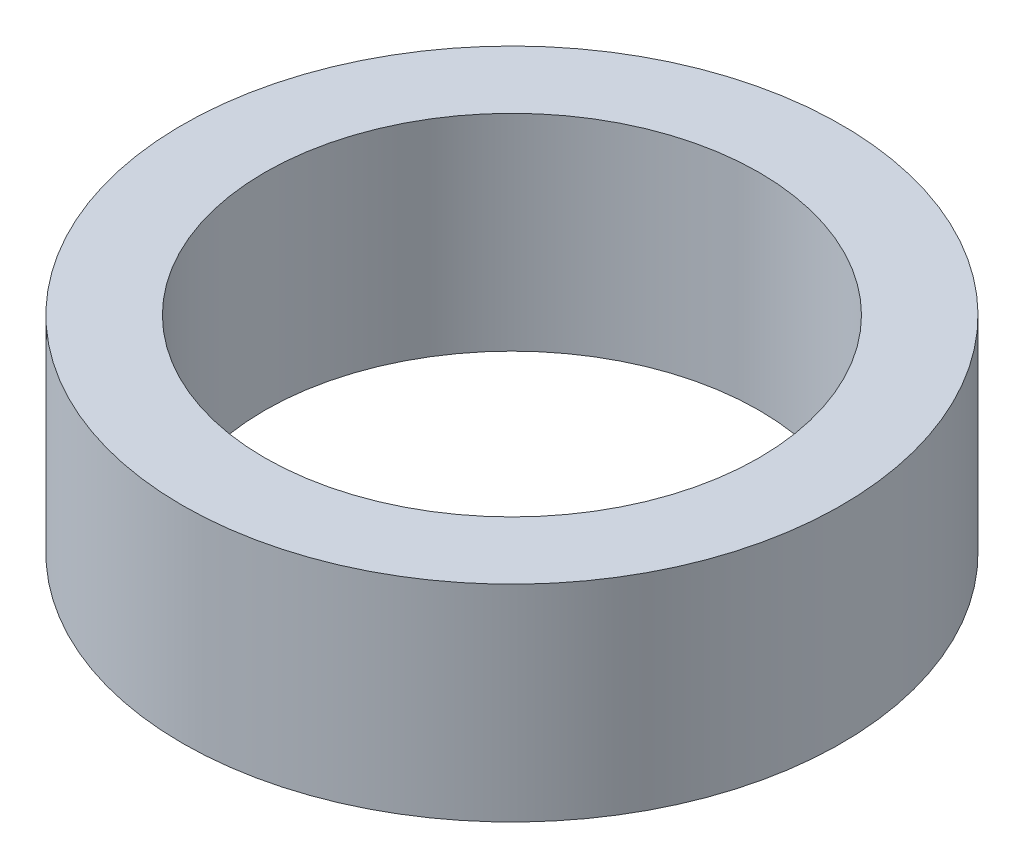
ISO-10303-21;
HEADER;
FILE_DESCRIPTION(('STEP AP214'),'2;1');
FILE_NAME('part.step','',(''),(''),'','','');
FILE_SCHEMA(('AUTOMOTIVE_DESIGN { 1 0 10303 214 1 1 1 1 }'));
ENDSEC;
DATA;
#1=APPLICATION_CONTEXT('core data for automotive mechanical design processes');
#2=APPLICATION_PROTOCOL_DEFINITION('international standard','automotive_design',2000,#1);
#3=PRODUCT_CONTEXT('',#1,'mechanical');
#4=PRODUCT('Part','Part','',(#3));
#5=PRODUCT_RELATED_PRODUCT_CATEGORY('part','',(#4));
#6=PRODUCT_DEFINITION_FORMATION('','',#4);
#7=PRODUCT_DEFINITION_CONTEXT('part definition',#1,'design');
#8=PRODUCT_DEFINITION('design','',#6,#7);
#9=PRODUCT_DEFINITION_SHAPE('','',#8);
#10=(LENGTH_UNIT() NAMED_UNIT(*) SI_UNIT(.MILLI.,.METRE.));
#11=(NAMED_UNIT(*) PLANE_ANGLE_UNIT() SI_UNIT($,.RADIAN.));
#12=(NAMED_UNIT(*) SI_UNIT($,.STERADIAN.) SOLID_ANGLE_UNIT());
#13=UNCERTAINTY_MEASURE_WITH_UNIT(LENGTH_MEASURE(1.E-05),#10,'distance_accuracy_value','');
#14=(GEOMETRIC_REPRESENTATION_CONTEXT(3) GLOBAL_UNCERTAINTY_ASSIGNED_CONTEXT((#13)) GLOBAL_UNIT_ASSIGNED_CONTEXT((#10,
#11,#12)) REPRESENTATION_CONTEXT('',''));
#15=CARTESIAN_POINT('',(0.,0.,0.));
#16=DIRECTION('',(0.,0.,1.));
#17=DIRECTION('',(1.,0.,0.));
#18=AXIS2_PLACEMENT_3D('',#15,#16,#17);
#19=CARTESIAN_POINT('',(0.,25.,0.));
#20=DIRECTION('',(0.,-1.,0.));
#21=DIRECTION('',(0.,0.,-1.));
#22=AXIS2_PLACEMENT_3D('',#19,#20,#21);
#23=CYLINDRICAL_SURFACE('',#22,40.);
#24=CARTESIAN_POINT('',(0.,25.,0.));
#25=DIRECTION('',(0.,1.,0.));
#26=DIRECTION('',(0.,0.,1.));
#27=AXIS2_PLACEMENT_3D('',#24,#25,#26);
#28=CIRCLE('',#27,40.);
#29=CARTESIAN_POINT('',(0.,25.,40.));
#30=VERTEX_POINT('',#29);
#31=EDGE_CURVE('E10',#30,#30,#28,.T.);
#32=ORIENTED_EDGE('',*,*,#31,.F.);
#33=EDGE_LOOP('',(#32));
#34=FACE_BOUND('',#33,.T.);
#35=CARTESIAN_POINT('',(0.,0.,0.));
#36=DIRECTION('',(0.,1.,0.));
#37=DIRECTION('',(0.,0.,1.));
#38=AXIS2_PLACEMENT_3D('',#35,#36,#37);
#39=CIRCLE('',#38,40.);
#40=CARTESIAN_POINT('',(0.,0.,40.));
#41=VERTEX_POINT('',#40);
#42=EDGE_CURVE('E37',#41,#41,#39,.T.);
#43=ORIENTED_EDGE('',*,*,#42,.T.);
#44=EDGE_LOOP('',(#43));
#45=FACE_BOUND('',#44,.T.);
#46=ADVANCED_FACE('F40',(#34,#45),#23,.T.);
#47=CARTESIAN_POINT('',(0.,25.,0.));
#48=DIRECTION('',(0.,1.,0.));
#49=DIRECTION('',(0.,0.,1.));
#50=AXIS2_PLACEMENT_3D('',#47,#48,#49);
#51=PLANE('',#50);
#52=CARTESIAN_POINT('',(0.,25.,0.));
#53=DIRECTION('',(0.,1.,0.));
#54=DIRECTION('',(0.,0.,1.));
#55=AXIS2_PLACEMENT_3D('',#52,#53,#54);
#56=CIRCLE('',#55,30.);
#57=CARTESIAN_POINT('',(0.,25.,30.));
#58=VERTEX_POINT('',#57);
#59=EDGE_CURVE('E50',#58,#58,#56,.T.);
#60=ORIENTED_EDGE('',*,*,#59,.F.);
#61=EDGE_LOOP('',(#60));
#62=FACE_BOUND('',#61,.T.);
#63=ORIENTED_EDGE('',*,*,#31,.T.);
#64=EDGE_LOOP('',(#63));
#65=FACE_BOUND('',#64,.T.);
#66=ADVANCED_FACE('F59',(#62,#65),#51,.T.);
#67=CARTESIAN_POINT('',(0.,0.,0.));
#68=DIRECTION('',(0.,1.,0.));
#69=DIRECTION('',(0.,0.,1.));
#70=AXIS2_PLACEMENT_3D('',#67,#68,#69);
#71=PLANE('',#70);
#72=CARTESIAN_POINT('',(0.,0.,0.));
#73=DIRECTION('',(0.,1.,0.));
#74=DIRECTION('',(0.,0.,1.));
#75=AXIS2_PLACEMENT_3D('',#72,#73,#74);
#76=CIRCLE('',#75,30.);
#77=CARTESIAN_POINT('',(0.,0.,30.));
#78=VERTEX_POINT('',#77);
#79=EDGE_CURVE('E47',#78,#78,#76,.T.);
#80=ORIENTED_EDGE('',*,*,#79,.T.);
#81=EDGE_LOOP('',(#80));
#82=FACE_BOUND('',#81,.T.);
#83=ORIENTED_EDGE('',*,*,#42,.F.);
#84=EDGE_LOOP('',(#83));
#85=FACE_BOUND('',#84,.T.);
#86=ADVANCED_FACE('F58',(#82,#85),#71,.F.);
#87=CARTESIAN_POINT('',(0.,25.,0.));
#88=DIRECTION('',(0.,-1.,0.));
#89=DIRECTION('',(0.,0.,-1.));
#90=AXIS2_PLACEMENT_3D('',#87,#88,#89);
#91=CYLINDRICAL_SURFACE('',#90,30.);
#92=ORIENTED_EDGE('',*,*,#59,.T.);
#93=EDGE_LOOP('',(#92));
#94=FACE_BOUND('',#93,.T.);
#95=ORIENTED_EDGE('',*,*,#79,.F.);
#96=EDGE_LOOP('',(#95));
#97=FACE_BOUND('',#96,.T.);
#98=ADVANCED_FACE('F54',(#94,#97),#91,.F.);
#99=CLOSED_SHELL('',(#46,#66,#86,#98));
#100=MANIFOLD_SOLID_BREP('B2',#99);
#101=ADVANCED_BREP_SHAPE_REPRESENTATION('',(#18,#100),#14);
#102=SHAPE_DEFINITION_REPRESENTATION(#9,#101);
ENDSEC;
END-ISO-10303-21;
